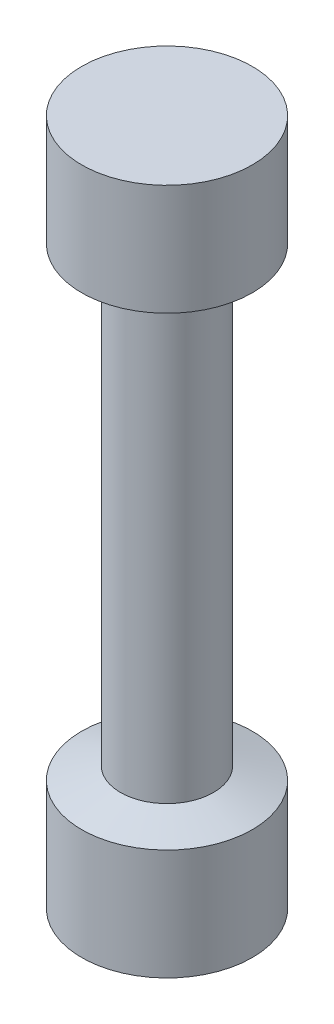
ISO-10303-21;
HEADER;
FILE_DESCRIPTION(('STEP AP214'),'2;1');
FILE_NAME('part.step','',(''),(''),'','','');
FILE_SCHEMA(('AUTOMOTIVE_DESIGN { 1 0 10303 214 1 1 1 1 }'));
ENDSEC;
DATA;
#1=APPLICATION_CONTEXT('core data for automotive mechanical design processes');
#2=APPLICATION_PROTOCOL_DEFINITION('international standard','automotive_design',2000,#1);
#3=PRODUCT_CONTEXT('',#1,'mechanical');
#4=PRODUCT('Part','Part','',(#3));
#5=PRODUCT_RELATED_PRODUCT_CATEGORY('part','',(#4));
#6=PRODUCT_DEFINITION_FORMATION('','',#4);
#7=PRODUCT_DEFINITION_CONTEXT('part definition',#1,'design');
#8=PRODUCT_DEFINITION('design','',#6,#7);
#9=PRODUCT_DEFINITION_SHAPE('','',#8);
#10=(LENGTH_UNIT() NAMED_UNIT(*) SI_UNIT(.MILLI.,.METRE.));
#11=(NAMED_UNIT(*) PLANE_ANGLE_UNIT() SI_UNIT($,.RADIAN.));
#12=(NAMED_UNIT(*) SI_UNIT($,.STERADIAN.) SOLID_ANGLE_UNIT());
#13=UNCERTAINTY_MEASURE_WITH_UNIT(LENGTH_MEASURE(1.E-05),#10,'distance_accuracy_value','');
#14=(GEOMETRIC_REPRESENTATION_CONTEXT(3) GLOBAL_UNCERTAINTY_ASSIGNED_CONTEXT((#13)) GLOBAL_UNIT_ASSIGNED_CONTEXT((#10,
#11,#12)) REPRESENTATION_CONTEXT('',''));
#15=CARTESIAN_POINT('',(0.,0.,0.));
#16=DIRECTION('',(0.,0.,1.));
#17=DIRECTION('',(1.,0.,0.));
#18=AXIS2_PLACEMENT_3D('',#15,#16,#17);
#19=CARTESIAN_POINT('',(0.,8.70000000000002,0.));
#20=DIRECTION('',(0.,-1.,0.));
#21=DIRECTION('',(1.,0.,0.));
#22=AXIS2_PLACEMENT_3D('',#19,#20,#21);
#23=CONICAL_SURFACE('',#22,6.69999999999997,1.25397184092668);
#24=CARTESIAN_POINT('',(0.,9.70000000000001,0.));
#25=DIRECTION('',(0.,-1.,0.));
#26=DIRECTION('',(1.,0.,0.));
#27=AXIS2_PLACEMENT_3D('',#24,#25,#26);
#28=CIRCLE('',#27,3.64999999999997);
#29=CARTESIAN_POINT('',(3.64999999999993,9.70000000000003,0.));
#30=VERTEX_POINT('',#29);
#31=EDGE_CURVE('E60',#30,#30,#28,.T.);
#32=ORIENTED_EDGE('',*,*,#31,.T.);
#33=EDGE_LOOP('',(#32));
#34=FACE_BOUND('',#33,.T.);
#35=CARTESIAN_POINT('',(0.,8.70000000000002,0.));
#36=DIRECTION('',(0.,-1.,0.));
#37=DIRECTION('',(1.,0.,0.));
#38=AXIS2_PLACEMENT_3D('',#35,#36,#37);
#39=CIRCLE('',#38,6.69999999999997);
#40=CARTESIAN_POINT('',(6.69999999999994,8.70000000000004,0.));
#41=VERTEX_POINT('',#40);
#42=EDGE_CURVE('E10',#41,#41,#39,.T.);
#43=ORIENTED_EDGE('',*,*,#42,.F.);
#44=EDGE_LOOP('',(#43));
#45=FACE_BOUND('',#44,.T.);
#46=ADVANCED_FACE('F38',(#34,#45),#23,.T.);
#47=CARTESIAN_POINT('',(1.00238050017738E-13,-28.7093185641803,0.));
#48=DIRECTION('',(0.,-1.,0.));
#49=DIRECTION('',(1.,0.,0.));
#50=AXIS2_PLACEMENT_3D('',#47,#48,#49);
#51=CYLINDRICAL_SURFACE('',#50,6.69999999999998);
#52=ORIENTED_EDGE('',*,*,#42,.T.);
#53=EDGE_LOOP('',(#52));
#54=FACE_BOUND('',#53,.T.);
#55=CARTESIAN_POINT('',(0.,0.,0.));
#56=DIRECTION('',(0.,-1.,0.));
#57=DIRECTION('',(1.,0.,0.));
#58=AXIS2_PLACEMENT_3D('',#55,#56,#57);
#59=CIRCLE('',#58,6.7);
#60=CARTESIAN_POINT('',(6.7,0.,0.));
#61=VERTEX_POINT('',#60);
#62=EDGE_CURVE('E44',#61,#61,#59,.T.);
#63=ORIENTED_EDGE('',*,*,#62,.F.);
#64=EDGE_LOOP('',(#63));
#65=FACE_BOUND('',#64,.T.);
#66=ADVANCED_FACE('F78',(#54,#65),#51,.T.);
#67=CARTESIAN_POINT('',(0.,0.,0.));
#68=DIRECTION('',(0.,-1.,0.));
#69=DIRECTION('',(1.,0.,0.));
#70=AXIS2_PLACEMENT_3D('',#67,#68,#69);
#71=PLANE('',#70);
#72=ORIENTED_EDGE('',*,*,#62,.T.);
#73=EDGE_LOOP('',(#72));
#74=FACE_BOUND('',#73,.T.);
#75=ADVANCED_FACE('F82',(#74),#71,.T.);
#76=CARTESIAN_POINT('',(0.,53.9,0.));
#77=DIRECTION('',(0.,-1.,0.));
#78=DIRECTION('',(1.,0.,0.));
#79=AXIS2_PLACEMENT_3D('',#76,#77,#78);
#80=PLANE('',#79);
#81=CARTESIAN_POINT('',(-1.88190844163645E-13,53.9,0.));
#82=DIRECTION('',(0.,-1.,0.));
#83=DIRECTION('',(1.,0.,0.));
#84=AXIS2_PLACEMENT_3D('',#81,#82,#83);
#85=CIRCLE('',#84,6.69999999999981);
#86=CARTESIAN_POINT('',(6.69999999999962,53.9,0.));
#87=VERTEX_POINT('',#86);
#88=EDGE_CURVE('E48',#87,#87,#85,.T.);
#89=ORIENTED_EDGE('',*,*,#88,.F.);
#90=EDGE_LOOP('',(#89));
#91=FACE_BOUND('',#90,.T.);
#92=ADVANCED_FACE('F86',(#91),#80,.F.);
#93=CARTESIAN_POINT('',(1.00238050017738E-13,-28.7093185641803,0.));
#94=DIRECTION('',(0.,-1.,0.));
#95=DIRECTION('',(1.,0.,0.));
#96=AXIS2_PLACEMENT_3D('',#93,#94,#95);
#97=CYLINDRICAL_SURFACE('',#96,6.69999999999983);
#98=CARTESIAN_POINT('',(-1.5781495651571E-13,45.2,0.));
#99=DIRECTION('',(0.,-1.,0.));
#100=DIRECTION('',(1.,0.,0.));
#101=AXIS2_PLACEMENT_3D('',#98,#99,#100);
#102=CIRCLE('',#101,6.69999999999984);
#103=CARTESIAN_POINT('',(6.69999999999969,45.2,0.));
#104=VERTEX_POINT('',#103);
#105=EDGE_CURVE('E52',#104,#104,#102,.T.);
#106=ORIENTED_EDGE('',*,*,#105,.F.);
#107=EDGE_LOOP('',(#106));
#108=FACE_BOUND('',#107,.T.);
#109=ORIENTED_EDGE('',*,*,#88,.T.);
#110=EDGE_LOOP('',(#109));
#111=FACE_BOUND('',#110,.T.);
#112=ADVANCED_FACE('F74',(#108,#111),#97,.T.);
#113=CARTESIAN_POINT('',(-1.5781495651571E-13,45.2,0.));
#114=DIRECTION('',(0.,1.,0.));
#115=DIRECTION('',(-1.,0.,0.));
#116=AXIS2_PLACEMENT_3D('',#113,#114,#115);
#117=CONICAL_SURFACE('',#116,6.69999999999984,1.25397184092667);
#118=CARTESIAN_POINT('',(-1.54323475176866E-13,44.2,0.));
#119=DIRECTION('',(0.,-1.,0.));
#120=DIRECTION('',(1.,0.,0.));
#121=AXIS2_PLACEMENT_3D('',#118,#119,#120);
#122=CIRCLE('',#121,3.64999999999985);
#123=CARTESIAN_POINT('',(3.64999999999969,44.2,0.));
#124=VERTEX_POINT('',#123);
#125=EDGE_CURVE('E57',#124,#124,#122,.T.);
#126=ORIENTED_EDGE('',*,*,#125,.F.);
#127=EDGE_LOOP('',(#126));
#128=FACE_BOUND('',#127,.T.);
#129=ORIENTED_EDGE('',*,*,#105,.T.);
#130=EDGE_LOOP('',(#129));
#131=FACE_BOUND('',#130,.T.);
#132=ADVANCED_FACE('F68',(#128,#131),#117,.T.);
#133=CARTESIAN_POINT('',(1.00238050017738E-13,-28.7093185641803,0.));
#134=DIRECTION('',(0.,-1.,0.));
#135=DIRECTION('',(1.,0.,0.));
#136=AXIS2_PLACEMENT_3D('',#133,#134,#135);
#137=CYLINDRICAL_SURFACE('',#136,3.64999999999991);
#138=ORIENTED_EDGE('',*,*,#125,.T.);
#139=EDGE_LOOP('',(#138));
#140=FACE_BOUND('',#139,.T.);
#141=ORIENTED_EDGE('',*,*,#31,.F.);
#142=EDGE_LOOP('',(#141));
#143=FACE_BOUND('',#142,.T.);
#144=ADVANCED_FACE('F66',(#140,#143),#137,.T.);
#145=CLOSED_SHELL('',(#46,#66,#75,#92,#112,#132,#144));
#146=MANIFOLD_SOLID_BREP('B2',#145);
#147=ADVANCED_BREP_SHAPE_REPRESENTATION('',(#18,#146),#14);
#148=SHAPE_DEFINITION_REPRESENTATION(#9,#147);
ENDSEC;
END-ISO-10303-21;
